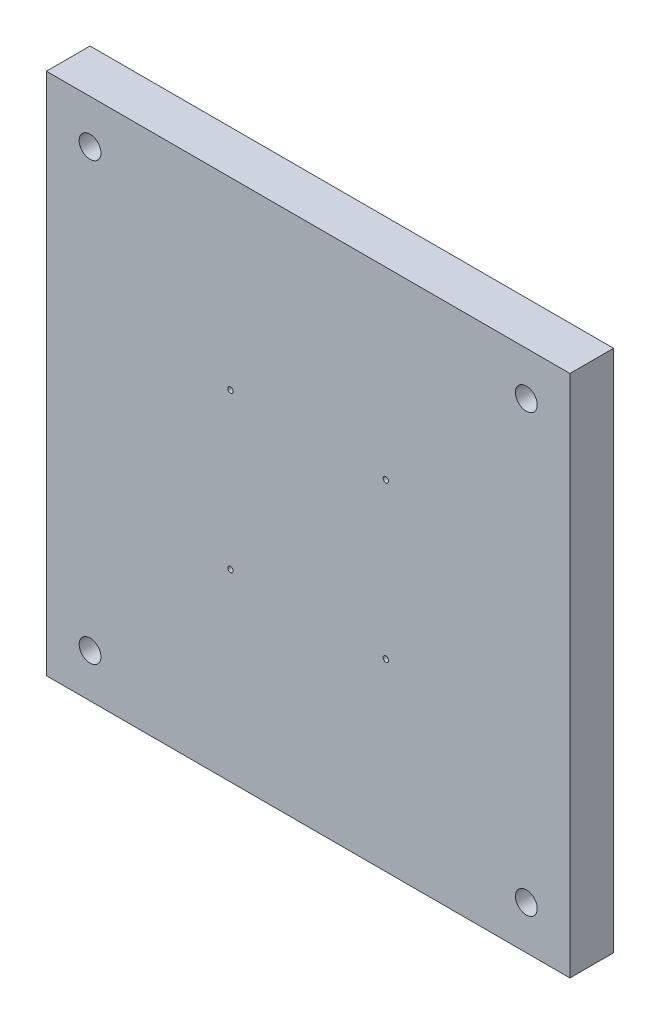
ISO-10303-21;
HEADER;
FILE_DESCRIPTION(('STEP AP214'),'2;1');
FILE_NAME('part.step','',(''),(''),'','','');
FILE_SCHEMA(('AUTOMOTIVE_DESIGN { 1 0 10303 214 1 1 1 1 }'));
ENDSEC;
DATA;
#1=APPLICATION_CONTEXT('core data for automotive mechanical design processes');
#2=APPLICATION_PROTOCOL_DEFINITION('international standard','automotive_design',2000,#1);
#3=PRODUCT_CONTEXT('',#1,'mechanical');
#4=PRODUCT('Part','Part','',(#3));
#5=PRODUCT_RELATED_PRODUCT_CATEGORY('part','',(#4));
#6=PRODUCT_DEFINITION_FORMATION('','',#4);
#7=PRODUCT_DEFINITION_CONTEXT('part definition',#1,'design');
#8=PRODUCT_DEFINITION('design','',#6,#7);
#9=PRODUCT_DEFINITION_SHAPE('','',#8);
#10=(LENGTH_UNIT() NAMED_UNIT(*) SI_UNIT(.MILLI.,.METRE.));
#11=(NAMED_UNIT(*) PLANE_ANGLE_UNIT() SI_UNIT($,.RADIAN.));
#12=(NAMED_UNIT(*) SI_UNIT($,.STERADIAN.) SOLID_ANGLE_UNIT());
#13=UNCERTAINTY_MEASURE_WITH_UNIT(LENGTH_MEASURE(1.E-05),#10,'distance_accuracy_value','');
#14=(GEOMETRIC_REPRESENTATION_CONTEXT(3) GLOBAL_UNCERTAINTY_ASSIGNED_CONTEXT((#13)) GLOBAL_UNIT_ASSIGNED_CONTEXT((#10,
#11,#12)) REPRESENTATION_CONTEXT('',''));
#15=CARTESIAN_POINT('',(0.,0.,0.));
#16=DIRECTION('',(0.,0.,1.));
#17=DIRECTION('',(1.,0.,0.));
#18=AXIS2_PLACEMENT_3D('',#15,#16,#17);
#19=CARTESIAN_POINT('',(0.,0.,6.35));
#20=DIRECTION('',(1.,0.,0.));
#21=DIRECTION('',(0.,0.,-1.));
#22=AXIS2_PLACEMENT_3D('',#19,#20,#21);
#23=PLANE('',#22);
#24=DIRECTION('',(0.,-1.,0.));
#25=VECTOR('',#24,1.);
#26=CARTESIAN_POINT('',(0.,0.,0.));
#27=LINE('',#26,#25);
#28=CARTESIAN_POINT('',(0.,76.2,0.));
#29=VERTEX_POINT('',#28);
#30=CARTESIAN_POINT('',(0.,0.,0.));
#31=VERTEX_POINT('',#30);
#32=EDGE_CURVE('E95',#29,#31,#27,.T.);
#33=ORIENTED_EDGE('',*,*,#32,.T.);
#34=DIRECTION('',(0.,0.,-1.));
#35=VECTOR('',#34,1.);
#36=CARTESIAN_POINT('',(0.,0.,6.35));
#37=LINE('',#36,#35);
#38=CARTESIAN_POINT('',(0.,0.,6.35));
#39=VERTEX_POINT('',#38);
#40=EDGE_CURVE('E11',#39,#31,#37,.T.);
#41=ORIENTED_EDGE('',*,*,#40,.F.);
#42=DIRECTION('',(0.,-1.,0.));
#43=VECTOR('',#42,1.);
#44=CARTESIAN_POINT('',(0.,0.,6.35));
#45=LINE('',#44,#43);
#46=CARTESIAN_POINT('',(0.,76.2,6.35));
#47=VERTEX_POINT('',#46);
#48=EDGE_CURVE('E83',#47,#39,#45,.T.);
#49=ORIENTED_EDGE('',*,*,#48,.F.);
#50=DIRECTION('',(0.,0.,-1.));
#51=VECTOR('',#50,1.);
#52=CARTESIAN_POINT('',(0.,76.2,6.35));
#53=LINE('',#52,#51);
#54=EDGE_CURVE('E91',#47,#29,#53,.T.);
#55=ORIENTED_EDGE('',*,*,#54,.T.);
#56=EDGE_LOOP('',(#33,#41,#49,#55));
#57=FACE_BOUND('',#56,.T.);
#58=ADVANCED_FACE('F32',(#57),#23,.F.);
#59=CARTESIAN_POINT('',(0.,0.,6.35));
#60=DIRECTION('',(0.,1.,0.));
#61=DIRECTION('',(0.,0.,1.));
#62=AXIS2_PLACEMENT_3D('',#59,#60,#61);
#63=PLANE('',#62);
#64=DIRECTION('',(1.,0.,0.));
#65=VECTOR('',#64,1.);
#66=CARTESIAN_POINT('',(0.,0.,0.));
#67=LINE('',#66,#65);
#68=CARTESIAN_POINT('',(76.2,0.,0.));
#69=VERTEX_POINT('',#68);
#70=EDGE_CURVE('E87',#31,#69,#67,.T.);
#71=ORIENTED_EDGE('',*,*,#70,.T.);
#72=DIRECTION('',(0.,0.,-1.));
#73=VECTOR('',#72,1.);
#74=CARTESIAN_POINT('',(76.2,0.,6.35));
#75=LINE('',#74,#73);
#76=CARTESIAN_POINT('',(76.2,0.,6.35));
#77=VERTEX_POINT('',#76);
#78=EDGE_CURVE('E40',#77,#69,#75,.T.);
#79=ORIENTED_EDGE('',*,*,#78,.F.);
#80=DIRECTION('',(1.,0.,0.));
#81=VECTOR('',#80,1.);
#82=CARTESIAN_POINT('',(0.,0.,6.35));
#83=LINE('',#82,#81);
#84=EDGE_CURVE('E78',#39,#77,#83,.T.);
#85=ORIENTED_EDGE('',*,*,#84,.F.);
#86=ORIENTED_EDGE('',*,*,#40,.T.);
#87=EDGE_LOOP('',(#71,#79,#85,#86));
#88=FACE_BOUND('',#87,.T.);
#89=ADVANCED_FACE('F86',(#88),#63,.F.);
#90=CARTESIAN_POINT('',(76.2,0.,6.35));
#91=DIRECTION('',(-1.,0.,0.));
#92=DIRECTION('',(0.,0.,1.));
#93=AXIS2_PLACEMENT_3D('',#90,#91,#92);
#94=PLANE('',#93);
#95=DIRECTION('',(0.,1.,0.));
#96=VECTOR('',#95,1.);
#97=CARTESIAN_POINT('',(76.2,0.,0.));
#98=LINE('',#97,#96);
#99=CARTESIAN_POINT('',(76.2,76.2,0.));
#100=VERTEX_POINT('',#99);
#101=EDGE_CURVE('E65',#69,#100,#98,.T.);
#102=ORIENTED_EDGE('',*,*,#101,.T.);
#103=DIRECTION('',(0.,0.,-1.));
#104=VECTOR('',#103,1.);
#105=CARTESIAN_POINT('',(76.2,76.2,6.35));
#106=LINE('',#105,#104);
#107=CARTESIAN_POINT('',(76.2,76.2,6.35));
#108=VERTEX_POINT('',#107);
#109=EDGE_CURVE('E88',#108,#100,#106,.T.);
#110=ORIENTED_EDGE('',*,*,#109,.F.);
#111=DIRECTION('',(0.,1.,0.));
#112=VECTOR('',#111,1.);
#113=CARTESIAN_POINT('',(76.2,0.,6.35));
#114=LINE('',#113,#112);
#115=EDGE_CURVE('E81',#77,#108,#114,.T.);
#116=ORIENTED_EDGE('',*,*,#115,.F.);
#117=ORIENTED_EDGE('',*,*,#78,.T.);
#118=EDGE_LOOP('',(#102,#110,#116,#117));
#119=FACE_BOUND('',#118,.T.);
#120=ADVANCED_FACE('F89',(#119),#94,.F.);
#121=CARTESIAN_POINT('',(0.,76.2,6.35));
#122=DIRECTION('',(0.,-1.,0.));
#123=DIRECTION('',(0.,0.,-1.));
#124=AXIS2_PLACEMENT_3D('',#121,#122,#123);
#125=PLANE('',#124);
#126=DIRECTION('',(-1.,0.,0.));
#127=VECTOR('',#126,1.);
#128=CARTESIAN_POINT('',(0.,76.2,0.));
#129=LINE('',#128,#127);
#130=EDGE_CURVE('E71',#100,#29,#129,.T.);
#131=ORIENTED_EDGE('',*,*,#130,.T.);
#132=ORIENTED_EDGE('',*,*,#54,.F.);
#133=DIRECTION('',(-1.,0.,0.));
#134=VECTOR('',#133,1.);
#135=CARTESIAN_POINT('',(0.,76.2,6.35));
#136=LINE('',#135,#134);
#137=EDGE_CURVE('E48',#108,#47,#136,.T.);
#138=ORIENTED_EDGE('',*,*,#137,.F.);
#139=ORIENTED_EDGE('',*,*,#109,.T.);
#140=EDGE_LOOP('',(#131,#132,#138,#139));
#141=FACE_BOUND('',#140,.T.);
#142=ADVANCED_FACE('F103',(#141),#125,.F.);
#143=CARTESIAN_POINT('',(0.,0.,6.35));
#144=DIRECTION('',(0.,0.,-1.));
#145=DIRECTION('',(-1.,0.,0.));
#146=AXIS2_PLACEMENT_3D('',#143,#144,#145);
#147=PLANE('',#146);
#148=CARTESIAN_POINT('',(69.8499999999999,6.35,6.35));
#149=DIRECTION('',(0.,0.,-1.));
#150=DIRECTION('',(-1.,0.,0.));
#151=AXIS2_PLACEMENT_3D('',#148,#149,#150);
#152=CIRCLE('',#151,1.5875);
#153=CARTESIAN_POINT('',(68.2624999999999,6.35,6.35));
#154=VERTEX_POINT('',#153);
#155=EDGE_CURVE('E148',#154,#154,#152,.T.);
#156=ORIENTED_EDGE('',*,*,#155,.T.);
#157=EDGE_LOOP('',(#156));
#158=FACE_BOUND('',#157,.T.);
#159=CARTESIAN_POINT('',(69.85,69.8499999999999,6.35));
#160=DIRECTION('',(0.,0.,-1.));
#161=DIRECTION('',(1.,0.,0.));
#162=AXIS2_PLACEMENT_3D('',#159,#160,#161);
#163=CIRCLE('',#162,1.5875);
#164=CARTESIAN_POINT('',(71.4375,69.8499999999999,6.35));
#165=VERTEX_POINT('',#164);
#166=EDGE_CURVE('E142',#165,#165,#163,.T.);
#167=ORIENTED_EDGE('',*,*,#166,.T.);
#168=EDGE_LOOP('',(#167));
#169=FACE_BOUND('',#168,.T.);
#170=CARTESIAN_POINT('',(6.35000000000003,6.35000000000002,6.35));
#171=DIRECTION('',(0.,0.,-1.));
#172=DIRECTION('',(1.,0.,0.));
#173=AXIS2_PLACEMENT_3D('',#170,#171,#172);
#174=CIRCLE('',#173,1.5875);
#175=CARTESIAN_POINT('',(7.93750000000003,6.35000000000002,6.35));
#176=VERTEX_POINT('',#175);
#177=EDGE_CURVE('E136',#176,#176,#174,.T.);
#178=ORIENTED_EDGE('',*,*,#177,.T.);
#179=EDGE_LOOP('',(#178));
#180=FACE_BOUND('',#179,.T.);
#181=CARTESIAN_POINT('',(6.35,69.85,6.35));
#182=DIRECTION('',(0.,0.,-1.));
#183=DIRECTION('',(-1.,0.,0.));
#184=AXIS2_PLACEMENT_3D('',#181,#182,#183);
#185=CIRCLE('',#184,1.5875);
#186=CARTESIAN_POINT('',(4.7625,69.85,6.35));
#187=VERTEX_POINT('',#186);
#188=EDGE_CURVE('E130',#187,#187,#185,.T.);
#189=ORIENTED_EDGE('',*,*,#188,.T.);
#190=EDGE_LOOP('',(#189));
#191=FACE_BOUND('',#190,.T.);
#192=CARTESIAN_POINT('',(49.4030000000001,26.797,6.35));
#193=DIRECTION('',(0.,0.,1.));
#194=DIRECTION('',(1.,0.,0.));
#195=AXIS2_PLACEMENT_3D('',#192,#193,#194);
#196=CIRCLE('',#195,0.396874999999996);
#197=CARTESIAN_POINT('',(49.7998750000001,26.797,6.35));
#198=VERTEX_POINT('',#197);
#199=EDGE_CURVE('E127',#198,#198,#196,.T.);
#200=ORIENTED_EDGE('',*,*,#199,.F.);
#201=EDGE_LOOP('',(#200));
#202=FACE_BOUND('',#201,.T.);
#203=CARTESIAN_POINT('',(26.7970000000001,49.403,6.35));
#204=DIRECTION('',(0.,0.,1.));
#205=DIRECTION('',(1.,0.,0.));
#206=AXIS2_PLACEMENT_3D('',#203,#204,#205);
#207=CIRCLE('',#206,0.396875);
#208=CARTESIAN_POINT('',(27.1938750000001,49.403,6.35));
#209=VERTEX_POINT('',#208);
#210=EDGE_CURVE('E121',#209,#209,#207,.T.);
#211=ORIENTED_EDGE('',*,*,#210,.F.);
#212=EDGE_LOOP('',(#211));
#213=FACE_BOUND('',#212,.T.);
#214=CARTESIAN_POINT('',(26.7970000000001,26.797,6.35));
#215=DIRECTION('',(0.,0.,1.));
#216=DIRECTION('',(1.,0.,0.));
#217=AXIS2_PLACEMENT_3D('',#214,#215,#216);
#218=CIRCLE('',#217,0.396875);
#219=CARTESIAN_POINT('',(27.1938750000001,26.797,6.35));
#220=VERTEX_POINT('',#219);
#221=EDGE_CURVE('E115',#220,#220,#218,.T.);
#222=ORIENTED_EDGE('',*,*,#221,.F.);
#223=EDGE_LOOP('',(#222));
#224=FACE_BOUND('',#223,.T.);
#225=CARTESIAN_POINT('',(49.4030000000001,49.403,6.35));
#226=DIRECTION('',(0.,0.,1.));
#227=DIRECTION('',(1.,0.,0.));
#228=AXIS2_PLACEMENT_3D('',#225,#226,#227);
#229=CIRCLE('',#228,0.396874999999996);
#230=CARTESIAN_POINT('',(49.7998750000001,49.403,6.35));
#231=VERTEX_POINT('',#230);
#232=EDGE_CURVE('E109',#231,#231,#229,.T.);
#233=ORIENTED_EDGE('',*,*,#232,.F.);
#234=EDGE_LOOP('',(#233));
#235=FACE_BOUND('',#234,.T.);
#236=ORIENTED_EDGE('',*,*,#48,.T.);
#237=ORIENTED_EDGE('',*,*,#84,.T.);
#238=ORIENTED_EDGE('',*,*,#115,.T.);
#239=ORIENTED_EDGE('',*,*,#137,.T.);
#240=EDGE_LOOP('',(#236,#237,#238,#239));
#241=FACE_BOUND('',#240,.T.);
#242=ADVANCED_FACE('F79',(#158,#169,#180,#191,#202,#213,#224,#235,#241),#147,.F.);
#243=CARTESIAN_POINT('',(0.,0.,0.));
#244=DIRECTION('',(0.,0.,-1.));
#245=DIRECTION('',(-1.,0.,0.));
#246=AXIS2_PLACEMENT_3D('',#243,#244,#245);
#247=PLANE('',#246);
#248=CARTESIAN_POINT('',(69.8499999999999,6.35,0.));
#249=DIRECTION('',(0.,0.,-1.));
#250=DIRECTION('',(-1.,0.,0.));
#251=AXIS2_PLACEMENT_3D('',#248,#249,#250);
#252=CIRCLE('',#251,1.5875);
#253=CARTESIAN_POINT('',(68.2624999999999,6.35,0.));
#254=VERTEX_POINT('',#253);
#255=EDGE_CURVE('E151',#254,#254,#252,.T.);
#256=ORIENTED_EDGE('',*,*,#255,.F.);
#257=EDGE_LOOP('',(#256));
#258=FACE_BOUND('',#257,.T.);
#259=CARTESIAN_POINT('',(69.85,69.8499999999999,0.));
#260=DIRECTION('',(0.,0.,-1.));
#261=DIRECTION('',(1.,0.,0.));
#262=AXIS2_PLACEMENT_3D('',#259,#260,#261);
#263=CIRCLE('',#262,1.5875);
#264=CARTESIAN_POINT('',(71.4375,69.8499999999999,0.));
#265=VERTEX_POINT('',#264);
#266=EDGE_CURVE('E145',#265,#265,#263,.T.);
#267=ORIENTED_EDGE('',*,*,#266,.F.);
#268=EDGE_LOOP('',(#267));
#269=FACE_BOUND('',#268,.T.);
#270=CARTESIAN_POINT('',(6.35000000000003,6.35000000000002,0.));
#271=DIRECTION('',(0.,0.,-1.));
#272=DIRECTION('',(1.,0.,0.));
#273=AXIS2_PLACEMENT_3D('',#270,#271,#272);
#274=CIRCLE('',#273,1.5875);
#275=CARTESIAN_POINT('',(7.93750000000003,6.35000000000002,0.));
#276=VERTEX_POINT('',#275);
#277=EDGE_CURVE('E139',#276,#276,#274,.T.);
#278=ORIENTED_EDGE('',*,*,#277,.F.);
#279=EDGE_LOOP('',(#278));
#280=FACE_BOUND('',#279,.T.);
#281=CARTESIAN_POINT('',(6.35,69.85,0.));
#282=DIRECTION('',(0.,0.,-1.));
#283=DIRECTION('',(-1.,0.,0.));
#284=AXIS2_PLACEMENT_3D('',#281,#282,#283);
#285=CIRCLE('',#284,1.5875);
#286=CARTESIAN_POINT('',(4.7625,69.85,0.));
#287=VERTEX_POINT('',#286);
#288=EDGE_CURVE('E133',#287,#287,#285,.T.);
#289=ORIENTED_EDGE('',*,*,#288,.F.);
#290=EDGE_LOOP('',(#289));
#291=FACE_BOUND('',#290,.T.);
#292=CARTESIAN_POINT('',(49.4030000000001,26.797,0.));
#293=DIRECTION('',(0.,0.,1.));
#294=DIRECTION('',(1.,0.,0.));
#295=AXIS2_PLACEMENT_3D('',#292,#293,#294);
#296=CIRCLE('',#295,0.396874999999996);
#297=CARTESIAN_POINT('',(49.7998750000001,26.797,0.));
#298=VERTEX_POINT('',#297);
#299=EDGE_CURVE('E124',#298,#298,#296,.T.);
#300=ORIENTED_EDGE('',*,*,#299,.T.);
#301=EDGE_LOOP('',(#300));
#302=FACE_BOUND('',#301,.T.);
#303=CARTESIAN_POINT('',(26.7970000000001,49.403,0.));
#304=DIRECTION('',(0.,0.,1.));
#305=DIRECTION('',(1.,0.,0.));
#306=AXIS2_PLACEMENT_3D('',#303,#304,#305);
#307=CIRCLE('',#306,0.396875);
#308=CARTESIAN_POINT('',(27.1938750000001,49.403,0.));
#309=VERTEX_POINT('',#308);
#310=EDGE_CURVE('E118',#309,#309,#307,.T.);
#311=ORIENTED_EDGE('',*,*,#310,.T.);
#312=EDGE_LOOP('',(#311));
#313=FACE_BOUND('',#312,.T.);
#314=CARTESIAN_POINT('',(26.7970000000001,26.797,0.));
#315=DIRECTION('',(0.,0.,1.));
#316=DIRECTION('',(1.,0.,0.));
#317=AXIS2_PLACEMENT_3D('',#314,#315,#316);
#318=CIRCLE('',#317,0.396875);
#319=CARTESIAN_POINT('',(27.1938750000001,26.797,0.));
#320=VERTEX_POINT('',#319);
#321=EDGE_CURVE('E112',#320,#320,#318,.T.);
#322=ORIENTED_EDGE('',*,*,#321,.T.);
#323=EDGE_LOOP('',(#322));
#324=FACE_BOUND('',#323,.T.);
#325=CARTESIAN_POINT('',(49.4030000000001,49.403,0.));
#326=DIRECTION('',(0.,0.,1.));
#327=DIRECTION('',(1.,0.,0.));
#328=AXIS2_PLACEMENT_3D('',#325,#326,#327);
#329=CIRCLE('',#328,0.396874999999996);
#330=CARTESIAN_POINT('',(49.7998750000001,49.403,0.));
#331=VERTEX_POINT('',#330);
#332=EDGE_CURVE('E98',#331,#331,#329,.T.);
#333=ORIENTED_EDGE('',*,*,#332,.T.);
#334=EDGE_LOOP('',(#333));
#335=FACE_BOUND('',#334,.T.);
#336=ORIENTED_EDGE('',*,*,#32,.F.);
#337=ORIENTED_EDGE('',*,*,#130,.F.);
#338=ORIENTED_EDGE('',*,*,#101,.F.);
#339=ORIENTED_EDGE('',*,*,#70,.F.);
#340=EDGE_LOOP('',(#336,#337,#338,#339));
#341=FACE_BOUND('',#340,.T.);
#342=ADVANCED_FACE('F106',(#258,#269,#280,#291,#302,#313,#324,#335,#341),#247,.T.);
#343=CARTESIAN_POINT('',(49.4030000000001,49.403,0.));
#344=DIRECTION('',(0.,0.,1.));
#345=DIRECTION('',(1.,0.,0.));
#346=AXIS2_PLACEMENT_3D('',#343,#344,#345);
#347=CYLINDRICAL_SURFACE('',#346,0.396874999999996);
#348=ORIENTED_EDGE('',*,*,#332,.F.);
#349=EDGE_LOOP('',(#348));
#350=FACE_BOUND('',#349,.T.);
#351=ORIENTED_EDGE('',*,*,#232,.T.);
#352=EDGE_LOOP('',(#351));
#353=FACE_BOUND('',#352,.T.);
#354=ADVANCED_FACE('F168',(#350,#353),#347,.F.);
#355=CARTESIAN_POINT('',(26.7970000000001,26.797,0.));
#356=DIRECTION('',(0.,0.,1.));
#357=DIRECTION('',(1.,0.,0.));
#358=AXIS2_PLACEMENT_3D('',#355,#356,#357);
#359=CYLINDRICAL_SURFACE('',#358,0.396875);
#360=ORIENTED_EDGE('',*,*,#321,.F.);
#361=EDGE_LOOP('',(#360));
#362=FACE_BOUND('',#361,.T.);
#363=ORIENTED_EDGE('',*,*,#221,.T.);
#364=EDGE_LOOP('',(#363));
#365=FACE_BOUND('',#364,.T.);
#366=ADVANCED_FACE('F186',(#362,#365),#359,.F.);
#367=CARTESIAN_POINT('',(26.7970000000001,49.403,0.));
#368=DIRECTION('',(0.,0.,1.));
#369=DIRECTION('',(1.,0.,0.));
#370=AXIS2_PLACEMENT_3D('',#367,#368,#369);
#371=CYLINDRICAL_SURFACE('',#370,0.396875);
#372=ORIENTED_EDGE('',*,*,#310,.F.);
#373=EDGE_LOOP('',(#372));
#374=FACE_BOUND('',#373,.T.);
#375=ORIENTED_EDGE('',*,*,#210,.T.);
#376=EDGE_LOOP('',(#375));
#377=FACE_BOUND('',#376,.T.);
#378=ADVANCED_FACE('F227',(#374,#377),#371,.F.);
#379=CARTESIAN_POINT('',(49.4030000000001,26.797,0.));
#380=DIRECTION('',(0.,0.,1.));
#381=DIRECTION('',(1.,0.,0.));
#382=AXIS2_PLACEMENT_3D('',#379,#380,#381);
#383=CYLINDRICAL_SURFACE('',#382,0.396874999999996);
#384=ORIENTED_EDGE('',*,*,#299,.F.);
#385=EDGE_LOOP('',(#384));
#386=FACE_BOUND('',#385,.T.);
#387=ORIENTED_EDGE('',*,*,#199,.T.);
#388=EDGE_LOOP('',(#387));
#389=FACE_BOUND('',#388,.T.);
#390=ADVANCED_FACE('F237',(#386,#389),#383,.F.);
#391=CARTESIAN_POINT('',(6.35,69.85,6.35));
#392=DIRECTION('',(0.,0.,-1.));
#393=DIRECTION('',(-1.,0.,0.));
#394=AXIS2_PLACEMENT_3D('',#391,#392,#393);
#395=CYLINDRICAL_SURFACE('',#394,1.5875);
#396=ORIENTED_EDGE('',*,*,#188,.F.);
#397=EDGE_LOOP('',(#396));
#398=FACE_BOUND('',#397,.T.);
#399=ORIENTED_EDGE('',*,*,#288,.T.);
#400=EDGE_LOOP('',(#399));
#401=FACE_BOUND('',#400,.T.);
#402=ADVANCED_FACE('F246',(#398,#401),#395,.F.);
#403=CARTESIAN_POINT('',(6.35000000000003,6.35000000000002,6.35));
#404=DIRECTION('',(0.,0.,-1.));
#405=DIRECTION('',(-1.,0.,0.));
#406=AXIS2_PLACEMENT_3D('',#403,#404,#405);
#407=CYLINDRICAL_SURFACE('',#406,1.5875);
#408=ORIENTED_EDGE('',*,*,#177,.F.);
#409=EDGE_LOOP('',(#408));
#410=FACE_BOUND('',#409,.T.);
#411=ORIENTED_EDGE('',*,*,#277,.T.);
#412=EDGE_LOOP('',(#411));
#413=FACE_BOUND('',#412,.T.);
#414=ADVANCED_FACE('F265',(#410,#413),#407,.F.);
#415=CARTESIAN_POINT('',(69.85,69.8499999999999,6.35));
#416=DIRECTION('',(0.,0.,-1.));
#417=DIRECTION('',(-1.,0.,0.));
#418=AXIS2_PLACEMENT_3D('',#415,#416,#417);
#419=CYLINDRICAL_SURFACE('',#418,1.5875);
#420=ORIENTED_EDGE('',*,*,#166,.F.);
#421=EDGE_LOOP('',(#420));
#422=FACE_BOUND('',#421,.T.);
#423=ORIENTED_EDGE('',*,*,#266,.T.);
#424=EDGE_LOOP('',(#423));
#425=FACE_BOUND('',#424,.T.);
#426=ADVANCED_FACE('F162',(#422,#425),#419,.F.);
#427=CARTESIAN_POINT('',(69.8499999999999,6.35,6.35));
#428=DIRECTION('',(0.,0.,-1.));
#429=DIRECTION('',(-1.,0.,0.));
#430=AXIS2_PLACEMENT_3D('',#427,#428,#429);
#431=CYLINDRICAL_SURFACE('',#430,1.5875);
#432=ORIENTED_EDGE('',*,*,#155,.F.);
#433=EDGE_LOOP('',(#432));
#434=FACE_BOUND('',#433,.T.);
#435=ORIENTED_EDGE('',*,*,#255,.T.);
#436=EDGE_LOOP('',(#435));
#437=FACE_BOUND('',#436,.T.);
#438=ADVANCED_FACE('F159',(#434,#437),#431,.F.);
#439=CLOSED_SHELL('',(#58,#89,#120,#142,#242,#342,#354,#366,#378,#390,#402,#414,#426,#438));
#440=MANIFOLD_SOLID_BREP('B2',#439);
#441=ADVANCED_BREP_SHAPE_REPRESENTATION('',(#18,#440),#14);
#442=SHAPE_DEFINITION_REPRESENTATION(#9,#441);
ENDSEC;
END-ISO-10303-21;
